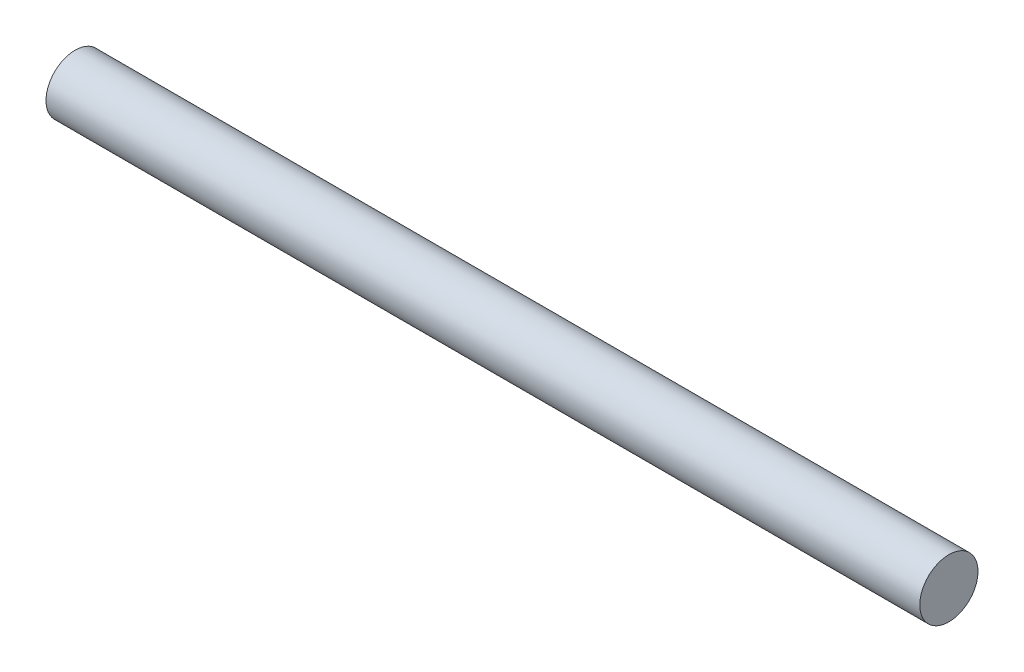
ISO-10303-21;
HEADER;
FILE_DESCRIPTION(('STEP AP214'),'2;1');
FILE_NAME('part.step','',(''),(''),'','','');
FILE_SCHEMA(('AUTOMOTIVE_DESIGN { 1 0 10303 214 1 1 1 1 }'));
ENDSEC;
DATA;
#1=APPLICATION_CONTEXT('core data for automotive mechanical design processes');
#2=APPLICATION_PROTOCOL_DEFINITION('international standard','automotive_design',2000,#1);
#3=PRODUCT_CONTEXT('',#1,'mechanical');
#4=PRODUCT('Part','Part','',(#3));
#5=PRODUCT_RELATED_PRODUCT_CATEGORY('part','',(#4));
#6=PRODUCT_DEFINITION_FORMATION('','',#4);
#7=PRODUCT_DEFINITION_CONTEXT('part definition',#1,'design');
#8=PRODUCT_DEFINITION('design','',#6,#7);
#9=PRODUCT_DEFINITION_SHAPE('','',#8);
#10=(LENGTH_UNIT() NAMED_UNIT(*) SI_UNIT(.MILLI.,.METRE.));
#11=(NAMED_UNIT(*) PLANE_ANGLE_UNIT() SI_UNIT($,.RADIAN.));
#12=(NAMED_UNIT(*) SI_UNIT($,.STERADIAN.) SOLID_ANGLE_UNIT());
#13=UNCERTAINTY_MEASURE_WITH_UNIT(LENGTH_MEASURE(1.E-05),#10,'distance_accuracy_value','');
#14=(GEOMETRIC_REPRESENTATION_CONTEXT(3) GLOBAL_UNCERTAINTY_ASSIGNED_CONTEXT((#13)) GLOBAL_UNIT_ASSIGNED_CONTEXT((#10,
#11,#12)) REPRESENTATION_CONTEXT('',''));
#15=CARTESIAN_POINT('',(0.,0.,0.));
#16=DIRECTION('',(0.,0.,1.));
#17=DIRECTION('',(1.,0.,0.));
#18=AXIS2_PLACEMENT_3D('',#15,#16,#17);
#19=CARTESIAN_POINT('',(75.,0.,0.));
#20=DIRECTION('',(-1.,0.,0.));
#21=DIRECTION('',(0.,-1.,0.));
#22=AXIS2_PLACEMENT_3D('',#19,#20,#21);
#23=PLANE('',#22);
#24=CARTESIAN_POINT('',(75.,0.,0.));
#25=DIRECTION('',(1.,0.,0.));
#26=DIRECTION('',(0.,1.,0.));
#27=AXIS2_PLACEMENT_3D('',#24,#25,#26);
#28=CIRCLE('',#27,4.99999999999998);
#29=CARTESIAN_POINT('',(75.,4.99999999999999,0.));
#30=VERTEX_POINT('',#29);
#31=EDGE_CURVE('E10',#30,#30,#28,.T.);
#32=ORIENTED_EDGE('',*,*,#31,.T.);
#33=EDGE_LOOP('',(#32));
#34=FACE_BOUND('',#33,.T.);
#35=ADVANCED_FACE('F31',(#34),#23,.F.);
#36=CARTESIAN_POINT('',(0.,0.,0.));
#37=DIRECTION('',(1.,0.,0.));
#38=DIRECTION('',(0.,1.,0.));
#39=AXIS2_PLACEMENT_3D('',#36,#37,#38);
#40=CYLINDRICAL_SURFACE('',#39,4.99999999999999);
#41=ORIENTED_EDGE('',*,*,#31,.F.);
#42=EDGE_LOOP('',(#41));
#43=FACE_BOUND('',#42,.T.);
#44=CARTESIAN_POINT('',(-75.,0.,0.));
#45=DIRECTION('',(1.,0.,0.));
#46=DIRECTION('',(0.,1.,0.));
#47=AXIS2_PLACEMENT_3D('',#44,#45,#46);
#48=CIRCLE('',#47,5.);
#49=CARTESIAN_POINT('',(-75.,4.99999999999999,0.));
#50=VERTEX_POINT('',#49);
#51=EDGE_CURVE('E37',#50,#50,#48,.T.);
#52=ORIENTED_EDGE('',*,*,#51,.T.);
#53=EDGE_LOOP('',(#52));
#54=FACE_BOUND('',#53,.T.);
#55=ADVANCED_FACE('F43',(#43,#54),#40,.T.);
#56=CARTESIAN_POINT('',(-75.,0.,0.));
#57=DIRECTION('',(1.,0.,0.));
#58=DIRECTION('',(0.,1.,0.));
#59=AXIS2_PLACEMENT_3D('',#56,#57,#58);
#60=PLANE('',#59);
#61=ORIENTED_EDGE('',*,*,#51,.F.);
#62=EDGE_LOOP('',(#61));
#63=FACE_BOUND('',#62,.T.);
#64=ADVANCED_FACE('F45',(#63),#60,.F.);
#65=CLOSED_SHELL('',(#35,#55,#64));
#66=MANIFOLD_SOLID_BREP('B2',#65);
#67=ADVANCED_BREP_SHAPE_REPRESENTATION('',(#18,#66),#14);
#68=SHAPE_DEFINITION_REPRESENTATION(#9,#67);
ENDSEC;
END-ISO-10303-21;
